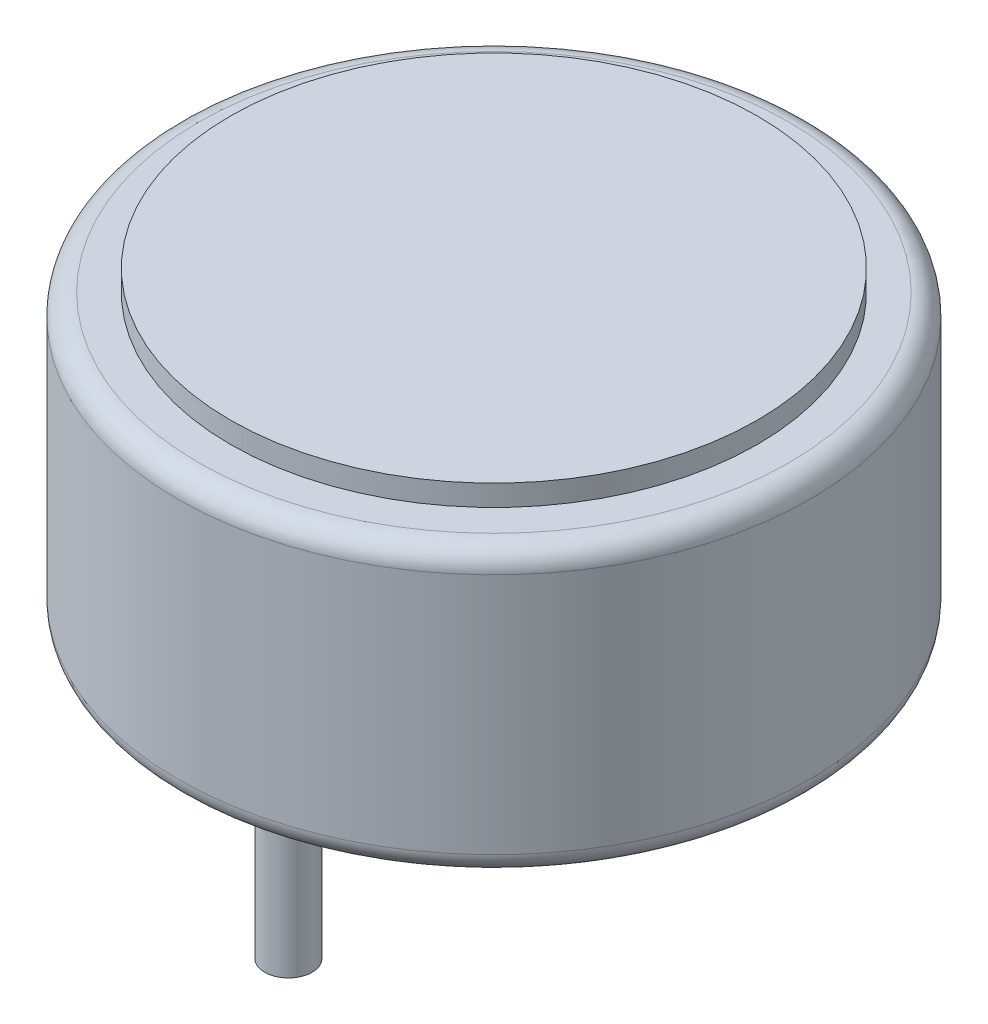
ISO-10303-21;
HEADER;
FILE_DESCRIPTION(('STEP AP214'),'2;1');
FILE_NAME('part.step','',(''),(''),'','','');
FILE_SCHEMA(('AUTOMOTIVE_DESIGN { 1 0 10303 214 1 1 1 1 }'));
ENDSEC;
DATA;
#1=APPLICATION_CONTEXT('core data for automotive mechanical design processes');
#2=APPLICATION_PROTOCOL_DEFINITION('international standard','automotive_design',2000,#1);
#3=PRODUCT_CONTEXT('',#1,'mechanical');
#4=PRODUCT('Part','Part','',(#3));
#5=PRODUCT_RELATED_PRODUCT_CATEGORY('part','',(#4));
#6=PRODUCT_DEFINITION_FORMATION('','',#4);
#7=PRODUCT_DEFINITION_CONTEXT('part definition',#1,'design');
#8=PRODUCT_DEFINITION('design','',#6,#7);
#9=PRODUCT_DEFINITION_SHAPE('','',#8);
#10=(LENGTH_UNIT() NAMED_UNIT(*) SI_UNIT(.MILLI.,.METRE.));
#11=(NAMED_UNIT(*) PLANE_ANGLE_UNIT() SI_UNIT($,.RADIAN.));
#12=(NAMED_UNIT(*) SI_UNIT($,.STERADIAN.) SOLID_ANGLE_UNIT());
#13=UNCERTAINTY_MEASURE_WITH_UNIT(LENGTH_MEASURE(1.E-05),#10,'distance_accuracy_value','');
#14=(GEOMETRIC_REPRESENTATION_CONTEXT(3) GLOBAL_UNCERTAINTY_ASSIGNED_CONTEXT((#13)) GLOBAL_UNIT_ASSIGNED_CONTEXT((#10,
#11,#12)) REPRESENTATION_CONTEXT('',''));
#15=CARTESIAN_POINT('',(0.,0.,0.));
#16=DIRECTION('',(0.,0.,1.));
#17=DIRECTION('',(1.,0.,0.));
#18=AXIS2_PLACEMENT_3D('',#15,#16,#17);
#19=CARTESIAN_POINT('',(0.,0.7,1.5));
#20=DIRECTION('',(0.,-1.,0.));
#21=DIRECTION('',(0.,0.,-1.));
#22=AXIS2_PLACEMENT_3D('',#19,#20,#21);
#23=CYLINDRICAL_SURFACE('',#22,0.2);
#24=CARTESIAN_POINT('',(0.,0.2,1.5));
#25=DIRECTION('',(0.,-1.,0.));
#26=DIRECTION('',(0.,0.,-1.));
#27=AXIS2_PLACEMENT_3D('',#24,#25,#26);
#28=CIRCLE('',#27,0.2);
#29=CARTESIAN_POINT('',(0.,0.2,1.3));
#30=VERTEX_POINT('',#29);
#31=EDGE_CURVE('E9',#30,#30,#28,.T.);
#32=ORIENTED_EDGE('',*,*,#31,.T.);
#33=EDGE_LOOP('',(#32));
#34=FACE_BOUND('',#33,.T.);
#35=CARTESIAN_POINT('',(0.,0.7,1.5));
#36=DIRECTION('',(0.,-1.,0.));
#37=DIRECTION('',(0.,0.,-1.));
#38=AXIS2_PLACEMENT_3D('',#35,#36,#37);
#39=CIRCLE('',#38,0.2);
#40=CARTESIAN_POINT('',(0.,0.7,1.3));
#41=VERTEX_POINT('',#40);
#42=EDGE_CURVE('E31',#41,#41,#39,.T.);
#43=ORIENTED_EDGE('',*,*,#42,.F.);
#44=EDGE_LOOP('',(#43));
#45=FACE_BOUND('',#44,.T.);
#46=ADVANCED_FACE('F14',(#34,#45),#23,.F.);
#47=CARTESIAN_POINT('',(0.,0.7,-1.5));
#48=DIRECTION('',(0.,-1.,0.));
#49=DIRECTION('',(0.,0.,-1.));
#50=AXIS2_PLACEMENT_3D('',#47,#48,#49);
#51=CYLINDRICAL_SURFACE('',#50,0.2);
#52=CARTESIAN_POINT('',(0.,0.2,-1.5));
#53=DIRECTION('',(0.,-1.,0.));
#54=DIRECTION('',(0.,0.,-1.));
#55=AXIS2_PLACEMENT_3D('',#52,#53,#54);
#56=CIRCLE('',#55,0.2);
#57=CARTESIAN_POINT('',(0.,0.2,-1.7));
#58=VERTEX_POINT('',#57);
#59=EDGE_CURVE('E22',#58,#58,#56,.T.);
#60=ORIENTED_EDGE('',*,*,#59,.T.);
#61=EDGE_LOOP('',(#60));
#62=FACE_BOUND('',#61,.T.);
#63=CARTESIAN_POINT('',(0.,0.7,-1.5));
#64=DIRECTION('',(0.,-1.,0.));
#65=DIRECTION('',(0.,0.,-1.));
#66=AXIS2_PLACEMENT_3D('',#63,#64,#65);
#67=CIRCLE('',#66,0.2);
#68=CARTESIAN_POINT('',(0.,0.7,-1.7));
#69=VERTEX_POINT('',#68);
#70=EDGE_CURVE('E32',#69,#69,#67,.T.);
#71=ORIENTED_EDGE('',*,*,#70,.F.);
#72=EDGE_LOOP('',(#71));
#73=FACE_BOUND('',#72,.T.);
#74=ADVANCED_FACE('F101',(#62,#73),#51,.F.);
#75=CARTESIAN_POINT('',(-1.,-2.8,0.95));
#76=DIRECTION('',(0.,1.,0.));
#77=DIRECTION('',(0.,0.,1.));
#78=AXIS2_PLACEMENT_3D('',#75,#76,#77);
#79=CYLINDRICAL_SURFACE('',#78,0.225);
#80=CARTESIAN_POINT('',(-1.,0.,0.95));
#81=DIRECTION('',(0.,-1.,0.));
#82=DIRECTION('',(0.,0.,-1.));
#83=AXIS2_PLACEMENT_3D('',#80,#81,#82);
#84=CIRCLE('',#83,0.225);
#85=CARTESIAN_POINT('',(-1.,0.,0.725));
#86=VERTEX_POINT('',#85);
#87=EDGE_CURVE('E27',#86,#86,#84,.T.);
#88=ORIENTED_EDGE('',*,*,#87,.T.);
#89=EDGE_LOOP('',(#88));
#90=FACE_BOUND('',#89,.T.);
#91=CARTESIAN_POINT('',(-1.,-2.8,0.95));
#92=DIRECTION('',(0.,-1.,0.));
#93=DIRECTION('',(0.,0.,-1.));
#94=AXIS2_PLACEMENT_3D('',#91,#92,#93);
#95=CIRCLE('',#94,0.225);
#96=CARTESIAN_POINT('',(-1.,-2.8,0.725));
#97=VERTEX_POINT('',#96);
#98=EDGE_CURVE('E34',#97,#97,#95,.T.);
#99=ORIENTED_EDGE('',*,*,#98,.F.);
#100=EDGE_LOOP('',(#99));
#101=FACE_BOUND('',#100,.T.);
#102=ADVANCED_FACE('F106',(#90,#101),#79,.T.);
#103=CARTESIAN_POINT('',(-1.,-2.8,-0.95));
#104=DIRECTION('',(0.,1.,0.));
#105=DIRECTION('',(0.,0.,1.));
#106=AXIS2_PLACEMENT_3D('',#103,#104,#105);
#107=CYLINDRICAL_SURFACE('',#106,0.225);
#108=CARTESIAN_POINT('',(-1.,0.,-0.95));
#109=DIRECTION('',(0.,-1.,0.));
#110=DIRECTION('',(0.,0.,-1.));
#111=AXIS2_PLACEMENT_3D('',#108,#109,#110);
#112=CIRCLE('',#111,0.225);
#113=CARTESIAN_POINT('',(-1.,0.,-1.175));
#114=VERTEX_POINT('',#113);
#115=EDGE_CURVE('E41',#114,#114,#112,.T.);
#116=ORIENTED_EDGE('',*,*,#115,.T.);
#117=EDGE_LOOP('',(#116));
#118=FACE_BOUND('',#117,.T.);
#119=CARTESIAN_POINT('',(-1.,-2.8,-0.95));
#120=DIRECTION('',(0.,-1.,0.));
#121=DIRECTION('',(0.,0.,-1.));
#122=AXIS2_PLACEMENT_3D('',#119,#120,#121);
#123=CIRCLE('',#122,0.225);
#124=CARTESIAN_POINT('',(-1.,-2.8,-1.175));
#125=VERTEX_POINT('',#124);
#126=EDGE_CURVE('E38',#125,#125,#123,.T.);
#127=ORIENTED_EDGE('',*,*,#126,.F.);
#128=EDGE_LOOP('',(#127));
#129=FACE_BOUND('',#128,.T.);
#130=ADVANCED_FACE('F113',(#118,#129),#107,.T.);
#131=CARTESIAN_POINT('',(-1.,0.,-0.95));
#132=DIRECTION('',(0.,1.,0.));
#133=DIRECTION('',(0.,0.,1.));
#134=AXIS2_PLACEMENT_3D('',#131,#132,#133);
#135=CYLINDRICAL_SURFACE('',#134,0.5);
#136=CARTESIAN_POINT('',(-1.,0.2,-0.95));
#137=DIRECTION('',(0.,-1.,0.));
#138=DIRECTION('',(0.,0.,-1.));
#139=AXIS2_PLACEMENT_3D('',#136,#137,#138);
#140=CIRCLE('',#139,0.5);
#141=CARTESIAN_POINT('',(-1.,0.2,-1.45));
#142=VERTEX_POINT('',#141);
#143=EDGE_CURVE('E47',#142,#142,#140,.T.);
#144=ORIENTED_EDGE('',*,*,#143,.T.);
#145=EDGE_LOOP('',(#144));
#146=FACE_BOUND('',#145,.T.);
#147=CARTESIAN_POINT('',(-1.,0.,-0.95));
#148=DIRECTION('',(0.,-1.,0.));
#149=DIRECTION('',(0.,0.,-1.));
#150=AXIS2_PLACEMENT_3D('',#147,#148,#149);
#151=CIRCLE('',#150,0.5);
#152=CARTESIAN_POINT('',(-1.,0.,-1.45));
#153=VERTEX_POINT('',#152);
#154=EDGE_CURVE('E48',#153,#153,#151,.T.);
#155=ORIENTED_EDGE('',*,*,#154,.F.);
#156=EDGE_LOOP('',(#155));
#157=FACE_BOUND('',#156,.T.);
#158=ADVANCED_FACE('F117',(#146,#157),#135,.T.);
#159=CARTESIAN_POINT('',(-1.,0.,0.95));
#160=DIRECTION('',(0.,1.,0.));
#161=DIRECTION('',(0.,0.,1.));
#162=AXIS2_PLACEMENT_3D('',#159,#160,#161);
#163=CYLINDRICAL_SURFACE('',#162,0.5);
#164=CARTESIAN_POINT('',(-1.,0.2,0.95));
#165=DIRECTION('',(0.,-1.,0.));
#166=DIRECTION('',(0.,0.,-1.));
#167=AXIS2_PLACEMENT_3D('',#164,#165,#166);
#168=CIRCLE('',#167,0.5);
#169=CARTESIAN_POINT('',(-1.,0.2,0.45));
#170=VERTEX_POINT('',#169);
#171=EDGE_CURVE('E55',#170,#170,#168,.T.);
#172=ORIENTED_EDGE('',*,*,#171,.T.);
#173=EDGE_LOOP('',(#172));
#174=FACE_BOUND('',#173,.T.);
#175=CARTESIAN_POINT('',(-1.,0.,0.95));
#176=DIRECTION('',(0.,-1.,0.));
#177=DIRECTION('',(0.,0.,-1.));
#178=AXIS2_PLACEMENT_3D('',#175,#176,#177);
#179=CIRCLE('',#178,0.5);
#180=CARTESIAN_POINT('',(-1.,0.,0.45));
#181=VERTEX_POINT('',#180);
#182=EDGE_CURVE('E51',#181,#181,#179,.T.);
#183=ORIENTED_EDGE('',*,*,#182,.F.);
#184=EDGE_LOOP('',(#183));
#185=FACE_BOUND('',#184,.T.);
#186=ADVANCED_FACE('F121',(#174,#185),#163,.T.);
#187=CARTESIAN_POINT('',(0.,2.9,0.));
#188=DIRECTION('',(0.,-1.,0.));
#189=DIRECTION('',(0.,0.,-1.));
#190=AXIS2_PLACEMENT_3D('',#187,#188,#189);
#191=CYLINDRICAL_SURFACE('',#190,2.5);
#192=CARTESIAN_POINT('',(0.,2.7,0.));
#193=DIRECTION('',(0.,1.,0.));
#194=DIRECTION('',(0.,0.,1.));
#195=AXIS2_PLACEMENT_3D('',#192,#193,#194);
#196=CIRCLE('',#195,2.5);
#197=CARTESIAN_POINT('',(0.,2.7,2.5));
#198=VERTEX_POINT('',#197);
#199=EDGE_CURVE('E61',#198,#198,#196,.T.);
#200=ORIENTED_EDGE('',*,*,#199,.T.);
#201=EDGE_LOOP('',(#200));
#202=FACE_BOUND('',#201,.T.);
#203=CARTESIAN_POINT('',(0.,2.9,0.));
#204=DIRECTION('',(0.,1.,0.));
#205=DIRECTION('',(0.,0.,1.));
#206=AXIS2_PLACEMENT_3D('',#203,#204,#205);
#207=CIRCLE('',#206,2.5);
#208=CARTESIAN_POINT('',(0.,2.9,2.5));
#209=VERTEX_POINT('',#208);
#210=EDGE_CURVE('E44',#209,#209,#207,.T.);
#211=ORIENTED_EDGE('',*,*,#210,.F.);
#212=EDGE_LOOP('',(#211));
#213=FACE_BOUND('',#212,.T.);
#214=ADVANCED_FACE('F125',(#202,#213),#191,.T.);
#215=CARTESIAN_POINT('',(0.,2.5,0.));
#216=DIRECTION('',(0.,1.,0.));
#217=DIRECTION('',(0.,0.,1.));
#218=AXIS2_PLACEMENT_3D('',#215,#216,#217);
#219=TOROIDAL_SURFACE('',#218,2.8,0.2);
#220=CARTESIAN_POINT('',(0.,2.7,0.));
#221=DIRECTION('',(0.,1.,0.));
#222=DIRECTION('',(0.,0.,1.));
#223=AXIS2_PLACEMENT_3D('',#220,#221,#222);
#224=CIRCLE('',#223,2.8);
#225=CARTESIAN_POINT('',(0.,2.7,2.8));
#226=VERTEX_POINT('',#225);
#227=EDGE_CURVE('E70',#226,#226,#224,.T.);
#228=ORIENTED_EDGE('',*,*,#227,.F.);
#229=EDGE_LOOP('',(#228));
#230=FACE_BOUND('',#229,.T.);
#231=CARTESIAN_POINT('',(0.,2.5,0.));
#232=DIRECTION('',(0.,-1.,0.));
#233=DIRECTION('',(0.,0.,1.));
#234=AXIS2_PLACEMENT_3D('',#231,#232,#233);
#235=CIRCLE('',#234,3.);
#236=CARTESIAN_POINT('',(0.,2.5,3.));
#237=VERTEX_POINT('',#236);
#238=EDGE_CURVE('E67',#237,#237,#235,.T.);
#239=ORIENTED_EDGE('',*,*,#238,.F.);
#240=EDGE_LOOP('',(#239));
#241=FACE_BOUND('',#240,.T.);
#242=ADVANCED_FACE('F96',(#230,#241),#219,.T.);
#243=CARTESIAN_POINT('',(0.,0.2,0.));
#244=DIRECTION('',(0.,1.,0.));
#245=DIRECTION('',(0.,0.,1.));
#246=AXIS2_PLACEMENT_3D('',#243,#244,#245);
#247=TOROIDAL_SURFACE('',#246,2.8,0.2);
#248=CARTESIAN_POINT('',(0.,0.2,0.));
#249=DIRECTION('',(0.,1.,0.));
#250=DIRECTION('',(0.,0.,1.));
#251=AXIS2_PLACEMENT_3D('',#248,#249,#250);
#252=CIRCLE('',#251,3.);
#253=CARTESIAN_POINT('',(0.,0.2,3.));
#254=VERTEX_POINT('',#253);
#255=EDGE_CURVE('E58',#254,#254,#252,.T.);
#256=ORIENTED_EDGE('',*,*,#255,.F.);
#257=EDGE_LOOP('',(#256));
#258=FACE_BOUND('',#257,.T.);
#259=CARTESIAN_POINT('',(0.,0.,0.));
#260=DIRECTION('',(0.,-1.,0.));
#261=DIRECTION('',(0.,0.,1.));
#262=AXIS2_PLACEMENT_3D('',#259,#260,#261);
#263=CIRCLE('',#262,2.8);
#264=CARTESIAN_POINT('',(0.,0.,2.8));
#265=VERTEX_POINT('',#264);
#266=EDGE_CURVE('E64',#265,#265,#263,.T.);
#267=ORIENTED_EDGE('',*,*,#266,.F.);
#268=EDGE_LOOP('',(#267));
#269=FACE_BOUND('',#268,.T.);
#270=ADVANCED_FACE('F85',(#258,#269),#247,.T.);
#271=CARTESIAN_POINT('',(0.,0.2,0.));
#272=DIRECTION('',(0.,1.,0.));
#273=DIRECTION('',(0.,0.,1.));
#274=AXIS2_PLACEMENT_3D('',#271,#272,#273);
#275=TOROIDAL_SURFACE('',#274,2.4,0.2);
#276=CARTESIAN_POINT('',(0.,0.,0.));
#277=DIRECTION('',(0.,1.,0.));
#278=DIRECTION('',(0.,0.,1.));
#279=AXIS2_PLACEMENT_3D('',#276,#277,#278);
#280=CIRCLE('',#279,2.4);
#281=CARTESIAN_POINT('',(0.,0.,2.4));
#282=VERTEX_POINT('',#281);
#283=EDGE_CURVE('E18',#282,#282,#280,.T.);
#284=ORIENTED_EDGE('',*,*,#283,.F.);
#285=EDGE_LOOP('',(#284));
#286=FACE_BOUND('',#285,.T.);
#287=CARTESIAN_POINT('',(0.,0.2,0.));
#288=DIRECTION('',(0.,-1.,0.));
#289=DIRECTION('',(0.,0.,-1.));
#290=AXIS2_PLACEMENT_3D('',#287,#288,#289);
#291=CIRCLE('',#290,2.2);
#292=CARTESIAN_POINT('',(0.,0.2,-2.2));
#293=VERTEX_POINT('',#292);
#294=EDGE_CURVE('E52',#293,#293,#291,.T.);
#295=ORIENTED_EDGE('',*,*,#294,.F.);
#296=EDGE_LOOP('',(#295));
#297=FACE_BOUND('',#296,.T.);
#298=ADVANCED_FACE('F82',(#286,#297),#275,.T.);
#299=CARTESIAN_POINT('',(0.,2.7,0.));
#300=DIRECTION('',(0.,-1.,0.));
#301=DIRECTION('',(0.,0.,-1.));
#302=AXIS2_PLACEMENT_3D('',#299,#300,#301);
#303=CYLINDRICAL_SURFACE('',#302,3.);
#304=ORIENTED_EDGE('',*,*,#255,.T.);
#305=EDGE_LOOP('',(#304));
#306=FACE_BOUND('',#305,.T.);
#307=ORIENTED_EDGE('',*,*,#238,.T.);
#308=EDGE_LOOP('',(#307));
#309=FACE_BOUND('',#308,.T.);
#310=ADVANCED_FACE('F84',(#306,#309),#303,.T.);
#311=CARTESIAN_POINT('',(-1.,0.,0.95));
#312=DIRECTION('',(0.,-1.,0.));
#313=DIRECTION('',(0.,0.,-1.));
#314=AXIS2_PLACEMENT_3D('',#311,#312,#313);
#315=PLANE('',#314);
#316=ORIENTED_EDGE('',*,*,#182,.T.);
#317=EDGE_LOOP('',(#316));
#318=FACE_BOUND('',#317,.T.);
#319=ORIENTED_EDGE('',*,*,#87,.F.);
#320=EDGE_LOOP('',(#319));
#321=FACE_BOUND('',#320,.T.);
#322=ADVANCED_FACE('F93',(#318,#321),#315,.T.);
#323=CARTESIAN_POINT('',(-1.,0.,-0.95));
#324=DIRECTION('',(0.,-1.,0.));
#325=DIRECTION('',(0.,0.,-1.));
#326=AXIS2_PLACEMENT_3D('',#323,#324,#325);
#327=PLANE('',#326);
#328=ORIENTED_EDGE('',*,*,#154,.T.);
#329=EDGE_LOOP('',(#328));
#330=FACE_BOUND('',#329,.T.);
#331=ORIENTED_EDGE('',*,*,#115,.F.);
#332=EDGE_LOOP('',(#331));
#333=FACE_BOUND('',#332,.T.);
#334=ADVANCED_FACE('F231',(#330,#333),#327,.T.);
#335=CARTESIAN_POINT('',(0.,0.2,0.));
#336=DIRECTION('',(0.,-1.,0.));
#337=DIRECTION('',(0.,0.,-1.));
#338=AXIS2_PLACEMENT_3D('',#335,#336,#337);
#339=PLANE('',#338);
#340=ORIENTED_EDGE('',*,*,#31,.F.);
#341=EDGE_LOOP('',(#340));
#342=FACE_BOUND('',#341,.T.);
#343=ORIENTED_EDGE('',*,*,#59,.F.);
#344=EDGE_LOOP('',(#343));
#345=FACE_BOUND('',#344,.T.);
#346=ORIENTED_EDGE('',*,*,#171,.F.);
#347=EDGE_LOOP('',(#346));
#348=FACE_BOUND('',#347,.T.);
#349=ORIENTED_EDGE('',*,*,#294,.T.);
#350=EDGE_LOOP('',(#349));
#351=FACE_BOUND('',#350,.T.);
#352=ORIENTED_EDGE('',*,*,#143,.F.);
#353=EDGE_LOOP('',(#352));
#354=FACE_BOUND('',#353,.T.);
#355=ADVANCED_FACE('F79',(#342,#345,#348,#351,#354),#339,.T.);
#356=CARTESIAN_POINT('',(0.,2.7,0.));
#357=DIRECTION('',(0.,1.,0.));
#358=DIRECTION('',(0.,0.,1.));
#359=AXIS2_PLACEMENT_3D('',#356,#357,#358);
#360=PLANE('',#359);
#361=ORIENTED_EDGE('',*,*,#227,.T.);
#362=EDGE_LOOP('',(#361));
#363=FACE_BOUND('',#362,.T.);
#364=ORIENTED_EDGE('',*,*,#199,.F.);
#365=EDGE_LOOP('',(#364));
#366=FACE_BOUND('',#365,.T.);
#367=ADVANCED_FACE('F139',(#363,#366),#360,.T.);
#368=CARTESIAN_POINT('',(0.,0.,0.));
#369=DIRECTION('',(0.,1.,0.));
#370=DIRECTION('',(0.,0.,1.));
#371=AXIS2_PLACEMENT_3D('',#368,#369,#370);
#372=PLANE('',#371);
#373=ORIENTED_EDGE('',*,*,#283,.T.);
#374=EDGE_LOOP('',(#373));
#375=FACE_BOUND('',#374,.T.);
#376=ORIENTED_EDGE('',*,*,#266,.T.);
#377=EDGE_LOOP('',(#376));
#378=FACE_BOUND('',#377,.T.);
#379=ADVANCED_FACE('F142',(#375,#378),#372,.F.);
#380=CARTESIAN_POINT('',(0.,2.9,0.));
#381=DIRECTION('',(0.,1.,0.));
#382=DIRECTION('',(0.,0.,1.));
#383=AXIS2_PLACEMENT_3D('',#380,#381,#382);
#384=PLANE('',#383);
#385=ORIENTED_EDGE('',*,*,#210,.T.);
#386=EDGE_LOOP('',(#385));
#387=FACE_BOUND('',#386,.T.);
#388=ADVANCED_FACE('F148',(#387),#384,.T.);
#389=CARTESIAN_POINT('',(-1.,-2.8,-0.95));
#390=DIRECTION('',(0.,-1.,0.));
#391=DIRECTION('',(0.,0.,-1.));
#392=AXIS2_PLACEMENT_3D('',#389,#390,#391);
#393=PLANE('',#392);
#394=ORIENTED_EDGE('',*,*,#126,.T.);
#395=EDGE_LOOP('',(#394));
#396=FACE_BOUND('',#395,.T.);
#397=ADVANCED_FACE('F150',(#396),#393,.T.);
#398=CARTESIAN_POINT('',(-1.,-2.8,0.95));
#399=DIRECTION('',(0.,-1.,0.));
#400=DIRECTION('',(0.,0.,-1.));
#401=AXIS2_PLACEMENT_3D('',#398,#399,#400);
#402=PLANE('',#401);
#403=ORIENTED_EDGE('',*,*,#98,.T.);
#404=EDGE_LOOP('',(#403));
#405=FACE_BOUND('',#404,.T.);
#406=ADVANCED_FACE('F156',(#405),#402,.T.);
#407=CARTESIAN_POINT('',(0.,0.7,-1.5));
#408=DIRECTION('',(0.,-1.,0.));
#409=DIRECTION('',(0.,0.,-1.));
#410=AXIS2_PLACEMENT_3D('',#407,#408,#409);
#411=PLANE('',#410);
#412=ORIENTED_EDGE('',*,*,#70,.T.);
#413=EDGE_LOOP('',(#412));
#414=FACE_BOUND('',#413,.T.);
#415=ADVANCED_FACE('F163',(#414),#411,.T.);
#416=CARTESIAN_POINT('',(0.,0.7,1.5));
#417=DIRECTION('',(0.,-1.,0.));
#418=DIRECTION('',(0.,0.,-1.));
#419=AXIS2_PLACEMENT_3D('',#416,#417,#418);
#420=PLANE('',#419);
#421=ORIENTED_EDGE('',*,*,#42,.T.);
#422=EDGE_LOOP('',(#421));
#423=FACE_BOUND('',#422,.T.);
#424=ADVANCED_FACE('F16',(#423),#420,.T.);
#425=CLOSED_SHELL('',(#46,#74,#102,#130,#158,#186,#214,#242,#270,#298,#310,#322,#334,#355,#367,
#379,#388,#397,#406,#415,#424));
#426=MANIFOLD_SOLID_BREP('B1',#425);
#427=ADVANCED_BREP_SHAPE_REPRESENTATION('',(#18,#426),#14);
#428=SHAPE_DEFINITION_REPRESENTATION(#9,#427);
ENDSEC;
END-ISO-10303-21;
